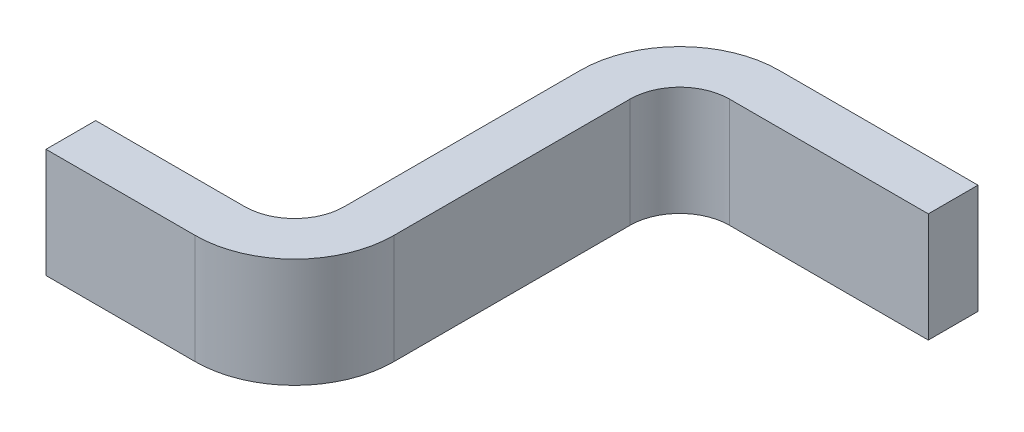
ISO-10303-21;
HEADER;
FILE_DESCRIPTION(('STEP AP214'),'2;1');
FILE_NAME('part.step','',(''),(''),'','','');
FILE_SCHEMA(('AUTOMOTIVE_DESIGN { 1 0 10303 214 1 1 1 1 }'));
ENDSEC;
DATA;
#1=APPLICATION_CONTEXT('core data for automotive mechanical design processes');
#2=APPLICATION_PROTOCOL_DEFINITION('international standard','automotive_design',2000,#1);
#3=PRODUCT_CONTEXT('',#1,'mechanical');
#4=PRODUCT('Part','Part','',(#3));
#5=PRODUCT_RELATED_PRODUCT_CATEGORY('part','',(#4));
#6=PRODUCT_DEFINITION_FORMATION('','',#4);
#7=PRODUCT_DEFINITION_CONTEXT('part definition',#1,'design');
#8=PRODUCT_DEFINITION('design','',#6,#7);
#9=PRODUCT_DEFINITION_SHAPE('','',#8);
#10=(LENGTH_UNIT() NAMED_UNIT(*) SI_UNIT(.MILLI.,.METRE.));
#11=(NAMED_UNIT(*) PLANE_ANGLE_UNIT() SI_UNIT($,.RADIAN.));
#12=(NAMED_UNIT(*) SI_UNIT($,.STERADIAN.) SOLID_ANGLE_UNIT());
#13=UNCERTAINTY_MEASURE_WITH_UNIT(LENGTH_MEASURE(1.E-05),#10,'distance_accuracy_value','');
#14=(GEOMETRIC_REPRESENTATION_CONTEXT(3) GLOBAL_UNCERTAINTY_ASSIGNED_CONTEXT((#13)) GLOBAL_UNIT_ASSIGNED_CONTEXT((#10,
#11,#12)) REPRESENTATION_CONTEXT('',''));
#15=CARTESIAN_POINT('',(0.,0.,0.));
#16=DIRECTION('',(0.,0.,1.));
#17=DIRECTION('',(1.,0.,0.));
#18=AXIS2_PLACEMENT_3D('',#15,#16,#17);
#19=CARTESIAN_POINT('',(3.9,2.86,0.675));
#20=DIRECTION('',(0.,-1.,0.));
#21=DIRECTION('',(0.,0.,-1.));
#22=AXIS2_PLACEMENT_3D('',#19,#20,#21);
#23=PLANE('',#22);
#24=CARTESIAN_POINT('',(3.8,2.86,0.675));
#25=DIRECTION('',(0.,-1.,0.));
#26=DIRECTION('',(0.,0.,-1.));
#27=AXIS2_PLACEMENT_3D('',#24,#25,#26);
#28=CIRCLE('',#27,0.1);
#29=CARTESIAN_POINT('',(3.9,2.86,0.675));
#30=VERTEX_POINT('',#29);
#31=CARTESIAN_POINT('',(3.8,2.86,0.775));
#32=VERTEX_POINT('',#31);
#33=EDGE_CURVE('E162',#30,#32,#28,.T.);
#34=ORIENTED_EDGE('',*,*,#33,.T.);
#35=DIRECTION('',(1.,0.,0.));
#36=VECTOR('',#35,1.);
#37=CARTESIAN_POINT('',(3.5,2.86,0.775));
#38=LINE('',#37,#36);
#39=CARTESIAN_POINT('',(3.5,2.86,0.775));
#40=VERTEX_POINT('',#39);
#41=EDGE_CURVE('E120',#32,#40,#38,.F.);
#42=ORIENTED_EDGE('',*,*,#41,.T.);
#43=DIRECTION('',(0.,0.,1.));
#44=VECTOR('',#43,1.);
#45=CARTESIAN_POINT('',(3.5,2.86,0.775));
#46=LINE('',#45,#44);
#47=CARTESIAN_POINT('',(3.5,2.86,0.875));
#48=VERTEX_POINT('',#47);
#49=EDGE_CURVE('E116',#48,#40,#46,.F.);
#50=ORIENTED_EDGE('',*,*,#49,.F.);
#51=DIRECTION('',(-1.,0.,0.));
#52=VECTOR('',#51,1.);
#53=CARTESIAN_POINT('',(3.5,2.86,0.875));
#54=LINE('',#53,#52);
#55=CARTESIAN_POINT('',(3.8,2.86,0.875));
#56=VERTEX_POINT('',#55);
#57=EDGE_CURVE('E111',#48,#56,#54,.F.);
#58=ORIENTED_EDGE('',*,*,#57,.T.);
#59=CARTESIAN_POINT('',(3.8,2.86,0.675));
#60=DIRECTION('',(0.,-1.,0.));
#61=DIRECTION('',(0.,0.,-1.));
#62=AXIS2_PLACEMENT_3D('',#59,#60,#61);
#63=CIRCLE('',#62,0.2);
#64=CARTESIAN_POINT('',(4.,2.86,0.675));
#65=VERTEX_POINT('',#64);
#66=EDGE_CURVE('E102',#65,#56,#63,.T.);
#67=ORIENTED_EDGE('',*,*,#66,.F.);
#68=DIRECTION('',(0.,0.,1.));
#69=VECTOR('',#68,1.);
#70=CARTESIAN_POINT('',(4.,2.86,0.675));
#71=LINE('',#70,#69);
#72=CARTESIAN_POINT('',(4.,2.86,0.2));
#73=VERTEX_POINT('',#72);
#74=EDGE_CURVE('E98',#65,#73,#71,.F.);
#75=ORIENTED_EDGE('',*,*,#74,.T.);
#76=CARTESIAN_POINT('',(4.1,2.86,0.2));
#77=DIRECTION('',(0.,1.,0.));
#78=DIRECTION('',(0.,0.,1.));
#79=AXIS2_PLACEMENT_3D('',#76,#77,#78);
#80=CIRCLE('',#79,0.1);
#81=CARTESIAN_POINT('',(4.1,2.86,0.1));
#82=VERTEX_POINT('',#81);
#83=EDGE_CURVE('E20',#73,#82,#80,.F.);
#84=ORIENTED_EDGE('',*,*,#83,.T.);
#85=DIRECTION('',(-1.,0.,0.));
#86=VECTOR('',#85,1.);
#87=CARTESIAN_POINT('',(4.1,2.86,0.1));
#88=LINE('',#87,#86);
#89=CARTESIAN_POINT('',(4.5,2.86,0.1));
#90=VERTEX_POINT('',#89);
#91=EDGE_CURVE('E145',#82,#90,#88,.F.);
#92=ORIENTED_EDGE('',*,*,#91,.T.);
#93=DIRECTION('',(0.,0.,1.));
#94=VECTOR('',#93,1.);
#95=CARTESIAN_POINT('',(4.5,2.86,0.));
#96=LINE('',#95,#94);
#97=CARTESIAN_POINT('',(4.5,2.86,0.));
#98=VERTEX_POINT('',#97);
#99=EDGE_CURVE('E139',#90,#98,#96,.F.);
#100=ORIENTED_EDGE('',*,*,#99,.T.);
#101=DIRECTION('',(1.,0.,0.));
#102=VECTOR('',#101,1.);
#103=CARTESIAN_POINT('',(4.1,2.86,0.));
#104=LINE('',#103,#102);
#105=CARTESIAN_POINT('',(4.1,2.86,0.));
#106=VERTEX_POINT('',#105);
#107=EDGE_CURVE('E132',#98,#106,#104,.F.);
#108=ORIENTED_EDGE('',*,*,#107,.T.);
#109=CARTESIAN_POINT('',(4.1,2.86,0.2));
#110=DIRECTION('',(0.,1.,0.));
#111=DIRECTION('',(0.,0.,1.));
#112=AXIS2_PLACEMENT_3D('',#109,#110,#111);
#113=CIRCLE('',#112,0.2);
#114=CARTESIAN_POINT('',(3.9,2.86,0.2));
#115=VERTEX_POINT('',#114);
#116=EDGE_CURVE('E135',#115,#106,#113,.F.);
#117=ORIENTED_EDGE('',*,*,#116,.F.);
#118=DIRECTION('',(0.,0.,-1.));
#119=VECTOR('',#118,1.);
#120=CARTESIAN_POINT('',(3.9,2.86,0.675));
#121=LINE('',#120,#119);
#122=EDGE_CURVE('E128',#115,#30,#121,.F.);
#123=ORIENTED_EDGE('',*,*,#122,.T.);
#124=EDGE_LOOP('',(#34,#42,#50,#58,#67,#75,#84,#92,#100,#108,#117,#123));
#125=FACE_BOUND('',#124,.T.);
#126=ADVANCED_FACE('F17',(#125),#23,.F.);
#127=CARTESIAN_POINT('',(4.1,2.86,0.2));
#128=DIRECTION('',(0.,1.,0.));
#129=DIRECTION('',(0.,0.,1.));
#130=AXIS2_PLACEMENT_3D('',#127,#128,#129);
#131=CYLINDRICAL_SURFACE('',#130,0.1);
#132=DIRECTION('',(0.,1.,0.));
#133=VECTOR('',#132,1.);
#134=CARTESIAN_POINT('',(4.,2.86,0.2));
#135=LINE('',#134,#133);
#136=CARTESIAN_POINT('',(4.,2.64,0.2));
#137=VERTEX_POINT('',#136);
#138=EDGE_CURVE('E91',#73,#137,#135,.F.);
#139=ORIENTED_EDGE('',*,*,#138,.T.);
#140=CARTESIAN_POINT('',(4.1,2.64,0.2));
#141=DIRECTION('',(0.,1.,0.));
#142=DIRECTION('',(0.,0.,1.));
#143=AXIS2_PLACEMENT_3D('',#140,#141,#142);
#144=CIRCLE('',#143,0.1);
#145=CARTESIAN_POINT('',(4.1,2.64,0.1));
#146=VERTEX_POINT('',#145);
#147=EDGE_CURVE('E103',#137,#146,#144,.F.);
#148=ORIENTED_EDGE('',*,*,#147,.T.);
#149=DIRECTION('',(0.,1.,0.));
#150=VECTOR('',#149,1.);
#151=CARTESIAN_POINT('',(4.1,2.86,0.1));
#152=LINE('',#151,#150);
#153=EDGE_CURVE('E92',#146,#82,#152,.T.);
#154=ORIENTED_EDGE('',*,*,#153,.T.);
#155=ORIENTED_EDGE('',*,*,#83,.F.);
#156=EDGE_LOOP('',(#139,#148,#154,#155));
#157=FACE_BOUND('',#156,.T.);
#158=ADVANCED_FACE('F89',(#157),#131,.F.);
#159=CARTESIAN_POINT('',(4.1,2.86,0.1));
#160=DIRECTION('',(0.,0.,-1.));
#161=DIRECTION('',(-1.,0.,0.));
#162=AXIS2_PLACEMENT_3D('',#159,#160,#161);
#163=PLANE('',#162);
#164=ORIENTED_EDGE('',*,*,#153,.F.);
#165=DIRECTION('',(1.,0.,0.));
#166=VECTOR('',#165,1.);
#167=CARTESIAN_POINT('',(4.,2.64,0.1));
#168=LINE('',#167,#166);
#169=CARTESIAN_POINT('',(4.5,2.64,0.1));
#170=VERTEX_POINT('',#169);
#171=EDGE_CURVE('E105',#146,#170,#168,.T.);
#172=ORIENTED_EDGE('',*,*,#171,.T.);
#173=DIRECTION('',(0.,1.,0.));
#174=VECTOR('',#173,1.);
#175=CARTESIAN_POINT('',(4.5,2.64,0.1));
#176=LINE('',#175,#174);
#177=EDGE_CURVE('E142',#170,#90,#176,.T.);
#178=ORIENTED_EDGE('',*,*,#177,.T.);
#179=ORIENTED_EDGE('',*,*,#91,.F.);
#180=EDGE_LOOP('',(#164,#172,#178,#179));
#181=FACE_BOUND('',#180,.T.);
#182=ADVANCED_FACE('F187',(#181),#163,.F.);
#183=CARTESIAN_POINT('',(4.5,2.64,0.));
#184=DIRECTION('',(-1.,0.,0.));
#185=DIRECTION('',(0.,0.,1.));
#186=AXIS2_PLACEMENT_3D('',#183,#184,#185);
#187=PLANE('',#186);
#188=ORIENTED_EDGE('',*,*,#177,.F.);
#189=DIRECTION('',(0.,0.,1.));
#190=VECTOR('',#189,1.);
#191=CARTESIAN_POINT('',(4.5,2.64,0.675));
#192=LINE('',#191,#190);
#193=CARTESIAN_POINT('',(4.5,2.64,0.));
#194=VERTEX_POINT('',#193);
#195=EDGE_CURVE('E176',#170,#194,#192,.F.);
#196=ORIENTED_EDGE('',*,*,#195,.T.);
#197=DIRECTION('',(0.,1.,0.));
#198=VECTOR('',#197,1.);
#199=CARTESIAN_POINT('',(4.5,2.64,0.));
#200=LINE('',#199,#198);
#201=EDGE_CURVE('E136',#194,#98,#200,.T.);
#202=ORIENTED_EDGE('',*,*,#201,.T.);
#203=ORIENTED_EDGE('',*,*,#99,.F.);
#204=EDGE_LOOP('',(#188,#196,#202,#203));
#205=FACE_BOUND('',#204,.T.);
#206=ADVANCED_FACE('F192',(#205),#187,.F.);
#207=CARTESIAN_POINT('',(4.1,2.64,0.));
#208=DIRECTION('',(0.,0.,1.));
#209=DIRECTION('',(1.,0.,0.));
#210=AXIS2_PLACEMENT_3D('',#207,#208,#209);
#211=PLANE('',#210);
#212=DIRECTION('',(0.,1.,0.));
#213=VECTOR('',#212,1.);
#214=CARTESIAN_POINT('',(4.1,2.64,0.));
#215=LINE('',#214,#213);
#216=CARTESIAN_POINT('',(4.1,2.64,0.));
#217=VERTEX_POINT('',#216);
#218=EDGE_CURVE('E163',#106,#217,#215,.F.);
#219=ORIENTED_EDGE('',*,*,#218,.F.);
#220=ORIENTED_EDGE('',*,*,#107,.F.);
#221=ORIENTED_EDGE('',*,*,#201,.F.);
#222=DIRECTION('',(1.,0.,0.));
#223=VECTOR('',#222,1.);
#224=CARTESIAN_POINT('',(4.,2.64,0.));
#225=LINE('',#224,#223);
#226=EDGE_CURVE('E159',#194,#217,#225,.F.);
#227=ORIENTED_EDGE('',*,*,#226,.T.);
#228=EDGE_LOOP('',(#219,#220,#221,#227));
#229=FACE_BOUND('',#228,.T.);
#230=ADVANCED_FACE('F264',(#229),#211,.F.);
#231=CARTESIAN_POINT('',(4.1,2.64,0.2));
#232=DIRECTION('',(0.,1.,0.));
#233=DIRECTION('',(0.,0.,1.));
#234=AXIS2_PLACEMENT_3D('',#231,#232,#233);
#235=CYLINDRICAL_SURFACE('',#234,0.2);
#236=ORIENTED_EDGE('',*,*,#116,.T.);
#237=ORIENTED_EDGE('',*,*,#218,.T.);
#238=CARTESIAN_POINT('',(4.1,2.64,0.2));
#239=DIRECTION('',(0.,1.,0.));
#240=DIRECTION('',(0.,0.,1.));
#241=AXIS2_PLACEMENT_3D('',#238,#239,#240);
#242=CIRCLE('',#241,0.2);
#243=CARTESIAN_POINT('',(3.9,2.64,0.2));
#244=VERTEX_POINT('',#243);
#245=EDGE_CURVE('E157',#217,#244,#242,.T.);
#246=ORIENTED_EDGE('',*,*,#245,.T.);
#247=DIRECTION('',(0.,1.,0.));
#248=VECTOR('',#247,1.);
#249=CARTESIAN_POINT('',(3.9,2.64,0.2));
#250=LINE('',#249,#248);
#251=EDGE_CURVE('E131',#244,#115,#250,.T.);
#252=ORIENTED_EDGE('',*,*,#251,.T.);
#253=EDGE_LOOP('',(#236,#237,#246,#252));
#254=FACE_BOUND('',#253,.T.);
#255=ADVANCED_FACE('F266',(#254),#235,.T.);
#256=CARTESIAN_POINT('',(3.9,2.64,0.675));
#257=DIRECTION('',(1.,0.,0.));
#258=DIRECTION('',(0.,0.,-1.));
#259=AXIS2_PLACEMENT_3D('',#256,#257,#258);
#260=PLANE('',#259);
#261=DIRECTION('',(0.,-1.,0.));
#262=VECTOR('',#261,1.);
#263=CARTESIAN_POINT('',(3.9,2.64,0.675));
#264=LINE('',#263,#262);
#265=CARTESIAN_POINT('',(3.9,2.64,0.675));
#266=VERTEX_POINT('',#265);
#267=EDGE_CURVE('E130',#266,#30,#264,.F.);
#268=ORIENTED_EDGE('',*,*,#267,.T.);
#269=ORIENTED_EDGE('',*,*,#122,.F.);
#270=ORIENTED_EDGE('',*,*,#251,.F.);
#271=DIRECTION('',(0.,0.,1.));
#272=VECTOR('',#271,1.);
#273=CARTESIAN_POINT('',(3.9,2.64,0.675));
#274=LINE('',#273,#272);
#275=EDGE_CURVE('E156',#244,#266,#274,.T.);
#276=ORIENTED_EDGE('',*,*,#275,.T.);
#277=EDGE_LOOP('',(#268,#269,#270,#276));
#278=FACE_BOUND('',#277,.T.);
#279=ADVANCED_FACE('F231',(#278),#260,.F.);
#280=CARTESIAN_POINT('',(3.80000000000001,2.64000000000001,0.675));
#281=DIRECTION('',(0.,-1.,0.));
#282=DIRECTION('',(0.,0.,-1.));
#283=AXIS2_PLACEMENT_3D('',#280,#281,#282);
#284=CYLINDRICAL_SURFACE('',#283,0.1);
#285=DIRECTION('',(0.,1.,0.));
#286=VECTOR('',#285,1.);
#287=CARTESIAN_POINT('',(3.80000000000001,2.64000000000001,0.775));
#288=LINE('',#287,#286);
#289=CARTESIAN_POINT('',(3.80000000000001,2.64000000000001,0.775));
#290=VERTEX_POINT('',#289);
#291=EDGE_CURVE('E125',#290,#32,#288,.T.);
#292=ORIENTED_EDGE('',*,*,#291,.T.);
#293=ORIENTED_EDGE('',*,*,#33,.F.);
#294=ORIENTED_EDGE('',*,*,#267,.F.);
#295=CARTESIAN_POINT('',(3.80000000000001,2.64000000000001,0.675));
#296=DIRECTION('',(0.,-1.,0.));
#297=DIRECTION('',(0.,0.,-1.));
#298=AXIS2_PLACEMENT_3D('',#295,#296,#297);
#299=CIRCLE('',#298,0.1);
#300=EDGE_CURVE('E152',#266,#290,#299,.T.);
#301=ORIENTED_EDGE('',*,*,#300,.T.);
#302=EDGE_LOOP('',(#292,#293,#294,#301));
#303=FACE_BOUND('',#302,.T.);
#304=ADVANCED_FACE('F235',(#303),#284,.F.);
#305=CARTESIAN_POINT('',(3.5,2.64,0.775));
#306=DIRECTION('',(0.,0.,1.));
#307=DIRECTION('',(1.,0.,0.));
#308=AXIS2_PLACEMENT_3D('',#305,#306,#307);
#309=PLANE('',#308);
#310=DIRECTION('',(0.,1.,0.));
#311=VECTOR('',#310,1.);
#312=CARTESIAN_POINT('',(3.5,2.64,0.775));
#313=LINE('',#312,#311);
#314=CARTESIAN_POINT('',(3.5,2.64,0.775));
#315=VERTEX_POINT('',#314);
#316=EDGE_CURVE('E119',#40,#315,#313,.F.);
#317=ORIENTED_EDGE('',*,*,#316,.F.);
#318=ORIENTED_EDGE('',*,*,#41,.F.);
#319=ORIENTED_EDGE('',*,*,#291,.F.);
#320=DIRECTION('',(1.,0.,0.));
#321=VECTOR('',#320,1.);
#322=CARTESIAN_POINT('',(4.,2.64,0.775));
#323=LINE('',#322,#321);
#324=EDGE_CURVE('E155',#290,#315,#323,.F.);
#325=ORIENTED_EDGE('',*,*,#324,.T.);
#326=EDGE_LOOP('',(#317,#318,#319,#325));
#327=FACE_BOUND('',#326,.T.);
#328=ADVANCED_FACE('F259',(#327),#309,.F.);
#329=CARTESIAN_POINT('',(3.5,2.64,0.775));
#330=DIRECTION('',(-1.,0.,0.));
#331=DIRECTION('',(0.,0.,1.));
#332=AXIS2_PLACEMENT_3D('',#329,#330,#331);
#333=PLANE('',#332);
#334=DIRECTION('',(0.,0.,1.));
#335=VECTOR('',#334,1.);
#336=CARTESIAN_POINT('',(3.5,2.64,0.675));
#337=LINE('',#336,#335);
#338=CARTESIAN_POINT('',(3.5,2.64,0.875));
#339=VERTEX_POINT('',#338);
#340=EDGE_CURVE('E217',#315,#339,#337,.T.);
#341=ORIENTED_EDGE('',*,*,#340,.T.);
#342=DIRECTION('',(0.,1.,0.));
#343=VECTOR('',#342,1.);
#344=CARTESIAN_POINT('',(3.5,2.86,0.875));
#345=LINE('',#344,#343);
#346=EDGE_CURVE('E113',#339,#48,#345,.T.);
#347=ORIENTED_EDGE('',*,*,#346,.T.);
#348=ORIENTED_EDGE('',*,*,#49,.T.);
#349=ORIENTED_EDGE('',*,*,#316,.T.);
#350=EDGE_LOOP('',(#341,#347,#348,#349));
#351=FACE_BOUND('',#350,.T.);
#352=ADVANCED_FACE('F255',(#351),#333,.T.);
#353=CARTESIAN_POINT('',(3.5,2.86,0.875));
#354=DIRECTION('',(0.,0.,-1.));
#355=DIRECTION('',(-1.,0.,0.));
#356=AXIS2_PLACEMENT_3D('',#353,#354,#355);
#357=PLANE('',#356);
#358=ORIENTED_EDGE('',*,*,#346,.F.);
#359=DIRECTION('',(1.,0.,0.));
#360=VECTOR('',#359,1.);
#361=CARTESIAN_POINT('',(4.,2.64,0.875));
#362=LINE('',#361,#360);
#363=CARTESIAN_POINT('',(3.80000000000001,2.64000000000001,0.875));
#364=VERTEX_POINT('',#363);
#365=EDGE_CURVE('E151',#339,#364,#362,.T.);
#366=ORIENTED_EDGE('',*,*,#365,.T.);
#367=DIRECTION('',(0.,-1.,0.));
#368=VECTOR('',#367,1.);
#369=CARTESIAN_POINT('',(3.8,2.86,0.875));
#370=LINE('',#369,#368);
#371=EDGE_CURVE('E99',#56,#364,#370,.T.);
#372=ORIENTED_EDGE('',*,*,#371,.F.);
#373=ORIENTED_EDGE('',*,*,#57,.F.);
#374=EDGE_LOOP('',(#358,#366,#372,#373));
#375=FACE_BOUND('',#374,.T.);
#376=ADVANCED_FACE('F251',(#375),#357,.F.);
#377=CARTESIAN_POINT('',(3.8,2.86,0.675));
#378=DIRECTION('',(0.,-1.,0.));
#379=DIRECTION('',(0.,0.,-1.));
#380=AXIS2_PLACEMENT_3D('',#377,#378,#379);
#381=CYLINDRICAL_SURFACE('',#380,0.2);
#382=CARTESIAN_POINT('',(3.80000000000001,2.64000000000001,0.675));
#383=DIRECTION('',(0.,-1.,0.));
#384=DIRECTION('',(0.,0.,-1.));
#385=AXIS2_PLACEMENT_3D('',#382,#383,#384);
#386=CIRCLE('',#385,0.2);
#387=CARTESIAN_POINT('',(4.,2.64,0.675));
#388=VERTEX_POINT('',#387);
#389=EDGE_CURVE('E26',#364,#388,#386,.F.);
#390=ORIENTED_EDGE('',*,*,#389,.T.);
#391=DIRECTION('',(0.,1.,0.));
#392=VECTOR('',#391,1.);
#393=CARTESIAN_POINT('',(4.,2.86,0.675));
#394=LINE('',#393,#392);
#395=EDGE_CURVE('E34',#388,#65,#394,.T.);
#396=ORIENTED_EDGE('',*,*,#395,.T.);
#397=ORIENTED_EDGE('',*,*,#66,.T.);
#398=ORIENTED_EDGE('',*,*,#371,.T.);
#399=EDGE_LOOP('',(#390,#396,#397,#398));
#400=FACE_BOUND('',#399,.T.);
#401=ADVANCED_FACE('F280',(#400),#381,.T.);
#402=CARTESIAN_POINT('',(4.,2.86,0.675));
#403=DIRECTION('',(-1.,0.,0.));
#404=DIRECTION('',(0.,0.,1.));
#405=AXIS2_PLACEMENT_3D('',#402,#403,#404);
#406=PLANE('',#405);
#407=ORIENTED_EDGE('',*,*,#395,.F.);
#408=DIRECTION('',(0.,0.,1.));
#409=VECTOR('',#408,1.);
#410=CARTESIAN_POINT('',(4.,2.64,0.675));
#411=LINE('',#410,#409);
#412=EDGE_CURVE('E11',#388,#137,#411,.F.);
#413=ORIENTED_EDGE('',*,*,#412,.T.);
#414=ORIENTED_EDGE('',*,*,#138,.F.);
#415=ORIENTED_EDGE('',*,*,#74,.F.);
#416=EDGE_LOOP('',(#407,#413,#414,#415));
#417=FACE_BOUND('',#416,.T.);
#418=ADVANCED_FACE('F97',(#417),#406,.F.);
#419=CARTESIAN_POINT('',(4.,2.64,0.675));
#420=DIRECTION('',(0.,1.,0.));
#421=DIRECTION('',(0.,0.,1.));
#422=AXIS2_PLACEMENT_3D('',#419,#420,#421);
#423=PLANE('',#422);
#424=ORIENTED_EDGE('',*,*,#389,.F.);
#425=ORIENTED_EDGE('',*,*,#365,.F.);
#426=ORIENTED_EDGE('',*,*,#340,.F.);
#427=ORIENTED_EDGE('',*,*,#324,.F.);
#428=ORIENTED_EDGE('',*,*,#300,.F.);
#429=ORIENTED_EDGE('',*,*,#275,.F.);
#430=ORIENTED_EDGE('',*,*,#245,.F.);
#431=ORIENTED_EDGE('',*,*,#226,.F.);
#432=ORIENTED_EDGE('',*,*,#195,.F.);
#433=ORIENTED_EDGE('',*,*,#171,.F.);
#434=ORIENTED_EDGE('',*,*,#147,.F.);
#435=ORIENTED_EDGE('',*,*,#412,.F.);
#436=EDGE_LOOP('',(#424,#425,#426,#427,#428,#429,#430,#431,#432,#433,#434,#435));
#437=FACE_BOUND('',#436,.T.);
#438=ADVANCED_FACE('F197',(#437),#423,.F.);
#439=CLOSED_SHELL('',(#126,#158,#182,#206,#230,#255,#279,#304,#328,#352,#376,#401,#418,#438));
#440=MANIFOLD_SOLID_BREP('B1',#439);
#441=ADVANCED_BREP_SHAPE_REPRESENTATION('',(#18,#440),#14);
#442=SHAPE_DEFINITION_REPRESENTATION(#9,#441);
ENDSEC;
END-ISO-10303-21;
